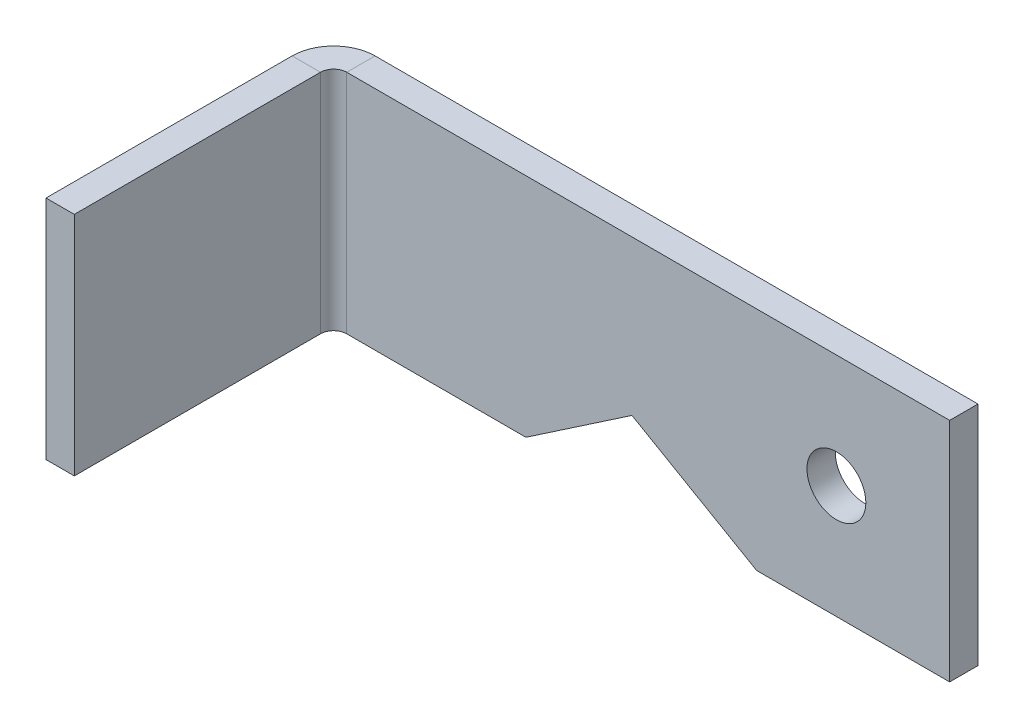
ISO-10303-21;
HEADER;
FILE_DESCRIPTION(('STEP AP214'),'2;1');
FILE_NAME('part.step','',(''),(''),'','','');
FILE_SCHEMA(('AUTOMOTIVE_DESIGN { 1 0 10303 214 1 1 1 1 }'));
ENDSEC;
DATA;
#1=APPLICATION_CONTEXT('core data for automotive mechanical design processes');
#2=APPLICATION_PROTOCOL_DEFINITION('international standard','automotive_design',2000,#1);
#3=PRODUCT_CONTEXT('',#1,'mechanical');
#4=PRODUCT('Part','Part','',(#3));
#5=PRODUCT_RELATED_PRODUCT_CATEGORY('part','',(#4));
#6=PRODUCT_DEFINITION_FORMATION('','',#4);
#7=PRODUCT_DEFINITION_CONTEXT('part definition',#1,'design');
#8=PRODUCT_DEFINITION('design','',#6,#7);
#9=PRODUCT_DEFINITION_SHAPE('','',#8);
#10=(LENGTH_UNIT() NAMED_UNIT(*) SI_UNIT(.MILLI.,.METRE.));
#11=(NAMED_UNIT(*) PLANE_ANGLE_UNIT() SI_UNIT($,.RADIAN.));
#12=(NAMED_UNIT(*) SI_UNIT($,.STERADIAN.) SOLID_ANGLE_UNIT());
#13=UNCERTAINTY_MEASURE_WITH_UNIT(LENGTH_MEASURE(1.E-05),#10,'distance_accuracy_value','');
#14=(GEOMETRIC_REPRESENTATION_CONTEXT(3) GLOBAL_UNCERTAINTY_ASSIGNED_CONTEXT((#13)) GLOBAL_UNIT_ASSIGNED_CONTEXT((#10,
#11,#12)) REPRESENTATION_CONTEXT('',''));
#15=CARTESIAN_POINT('',(0.,0.,0.));
#16=DIRECTION('',(0.,0.,1.));
#17=DIRECTION('',(1.,0.,0.));
#18=AXIS2_PLACEMENT_3D('',#15,#16,#17);
#19=CARTESIAN_POINT('',(-25.,-6.35,-1.5875));
#20=DIRECTION('',(0.,-1.,0.));
#21=DIRECTION('',(0.,0.,-1.));
#22=AXIS2_PLACEMENT_3D('',#19,#20,#21);
#23=PLANE('',#22);
#24=DIRECTION('',(0.,0.,-1.));
#25=VECTOR('',#24,1.);
#26=CARTESIAN_POINT('',(1.24638581634655,-6.35,-1.5875));
#27=LINE('',#26,#25);
#28=CARTESIAN_POINT('',(1.24638581634655,-6.35,0.));
#29=VERTEX_POINT('',#28);
#30=CARTESIAN_POINT('',(1.24638581634655,-6.35,-1.5875));
#31=VERTEX_POINT('',#30);
#32=EDGE_CURVE('E12',#29,#31,#27,.T.);
#33=ORIENTED_EDGE('',*,*,#32,.F.);
#34=DIRECTION('',(1.,0.,0.));
#35=VECTOR('',#34,1.);
#36=CARTESIAN_POINT('',(-25.,-6.35,0.));
#37=LINE('',#36,#35);
#38=CARTESIAN_POINT('',(-8.79806592064473,-6.35,0.));
#39=VERTEX_POINT('',#38);
#40=EDGE_CURVE('E148',#39,#29,#37,.T.);
#41=ORIENTED_EDGE('',*,*,#40,.F.);
#42=DIRECTION('',(0.,0.,1.));
#43=VECTOR('',#42,1.);
#44=CARTESIAN_POINT('',(-8.79806592064473,-6.35,-1.5875));
#45=LINE('',#44,#43);
#46=CARTESIAN_POINT('',(-8.79806592064473,-6.35,-1.5875));
#47=VERTEX_POINT('',#46);
#48=EDGE_CURVE('E170',#47,#39,#45,.T.);
#49=ORIENTED_EDGE('',*,*,#48,.F.);
#50=DIRECTION('',(1.,0.,0.));
#51=VECTOR('',#50,1.);
#52=CARTESIAN_POINT('',(-25.,-6.35,-1.5875));
#53=LINE('',#52,#51);
#54=EDGE_CURVE('E238',#47,#31,#53,.T.);
#55=ORIENTED_EDGE('',*,*,#54,.T.);
#56=EDGE_LOOP('',(#33,#41,#49,#55));
#57=FACE_BOUND('',#56,.T.);
#58=ADVANCED_FACE('F44',(#57),#23,.T.);
#59=CARTESIAN_POINT('',(-11.1221659206447,-6.34999999999999,14.5346659206447));
#60=DIRECTION('',(0.,-1.,0.));
#61=DIRECTION('',(-1.,0.,0.));
#62=AXIS2_PLACEMENT_3D('',#59,#60,#61);
#63=PLANE('',#62);
#64=DIRECTION('',(0.,0.,-1.));
#65=VECTOR('',#64,1.);
#66=CARTESIAN_POINT('',(-11.1221659206447,-6.34999999999999,14.5346659206447));
#67=LINE('',#66,#65);
#68=CARTESIAN_POINT('',(-11.1221659206447,-6.34999999999999,14.5346659206447));
#69=VERTEX_POINT('',#68);
#70=CARTESIAN_POINT('',(-11.1221659206447,-6.35,0.736600000000009));
#71=VERTEX_POINT('',#70);
#72=EDGE_CURVE('E177',#69,#71,#67,.T.);
#73=ORIENTED_EDGE('',*,*,#72,.T.);
#74=DIRECTION('',(1.,0.,0.));
#75=VECTOR('',#74,1.);
#76=CARTESIAN_POINT('',(-11.1221659206447,-6.35,0.736600000000007));
#77=LINE('',#76,#75);
#78=CARTESIAN_POINT('',(-9.53466592064473,-6.35,0.736600000000002));
#79=VERTEX_POINT('',#78);
#80=EDGE_CURVE('E134',#71,#79,#77,.T.);
#81=ORIENTED_EDGE('',*,*,#80,.T.);
#82=DIRECTION('',(0.,0.,-1.));
#83=VECTOR('',#82,1.);
#84=CARTESIAN_POINT('',(-9.53466592064468,-6.34999999999999,14.5346659206447));
#85=LINE('',#84,#83);
#86=CARTESIAN_POINT('',(-9.53466592064468,-6.34999999999999,14.5346659206447));
#87=VERTEX_POINT('',#86);
#88=EDGE_CURVE('E67',#87,#79,#85,.T.);
#89=ORIENTED_EDGE('',*,*,#88,.F.);
#90=DIRECTION('',(1.,0.,0.));
#91=VECTOR('',#90,1.);
#92=CARTESIAN_POINT('',(-11.1221659206447,-6.34999999999999,14.5346659206447));
#93=LINE('',#92,#91);
#94=EDGE_CURVE('E182',#69,#87,#93,.T.);
#95=ORIENTED_EDGE('',*,*,#94,.F.);
#96=EDGE_LOOP('',(#73,#81,#89,#95));
#97=FACE_BOUND('',#96,.T.);
#98=ADVANCED_FACE('F46',(#97),#63,.T.);
#99=CARTESIAN_POINT('',(-11.1221659206447,6.35000000000001,14.5346659206447));
#100=DIRECTION('',(0.,1.,0.));
#101=DIRECTION('',(1.,0.,0.));
#102=AXIS2_PLACEMENT_3D('',#99,#100,#101);
#103=PLANE('',#102);
#104=DIRECTION('',(0.,0.,1.));
#105=VECTOR('',#104,1.);
#106=CARTESIAN_POINT('',(-9.53466592064468,6.35000000000001,14.5346659206447));
#107=LINE('',#106,#105);
#108=CARTESIAN_POINT('',(-9.53466592064473,6.35,0.736600000000002));
#109=VERTEX_POINT('',#108);
#110=CARTESIAN_POINT('',(-9.53466592064468,6.35000000000001,14.5346659206447));
#111=VERTEX_POINT('',#110);
#112=EDGE_CURVE('E181',#109,#111,#107,.T.);
#113=ORIENTED_EDGE('',*,*,#112,.F.);
#114=DIRECTION('',(-1.,0.,0.));
#115=VECTOR('',#114,1.);
#116=CARTESIAN_POINT('',(-11.1221659206447,6.35,0.736600000000007));
#117=LINE('',#116,#115);
#118=CARTESIAN_POINT('',(-11.1221659206447,6.35000000000001,0.736600000000009));
#119=VERTEX_POINT('',#118);
#120=EDGE_CURVE('E190',#109,#119,#117,.T.);
#121=ORIENTED_EDGE('',*,*,#120,.T.);
#122=DIRECTION('',(0.,0.,1.));
#123=VECTOR('',#122,1.);
#124=CARTESIAN_POINT('',(-11.1221659206447,6.35000000000001,14.5346659206447));
#125=LINE('',#124,#123);
#126=CARTESIAN_POINT('',(-11.1221659206447,6.35000000000001,14.5346659206447));
#127=VERTEX_POINT('',#126);
#128=EDGE_CURVE('E178',#119,#127,#125,.T.);
#129=ORIENTED_EDGE('',*,*,#128,.T.);
#130=DIRECTION('',(1.,0.,0.));
#131=VECTOR('',#130,1.);
#132=CARTESIAN_POINT('',(-11.1221659206447,6.35000000000001,14.5346659206447));
#133=LINE('',#132,#131);
#134=EDGE_CURVE('E185',#127,#111,#133,.T.);
#135=ORIENTED_EDGE('',*,*,#134,.T.);
#136=EDGE_LOOP('',(#113,#121,#129,#135));
#137=FACE_BOUND('',#136,.T.);
#138=ADVANCED_FACE('F202',(#137),#103,.T.);
#139=CARTESIAN_POINT('',(-9.53466592064477,0.,-10.4653340793553));
#140=DIRECTION('',(1.,0.,0.));
#141=DIRECTION('',(0.,0.,-1.));
#142=AXIS2_PLACEMENT_3D('',#139,#140,#141);
#143=PLANE('',#142);
#144=ORIENTED_EDGE('',*,*,#88,.T.);
#145=DIRECTION('',(0.,1.,0.));
#146=VECTOR('',#145,1.);
#147=CARTESIAN_POINT('',(-9.53466592064473,0.,0.736600000000002));
#148=LINE('',#147,#146);
#149=EDGE_CURVE('E192',#79,#109,#148,.T.);
#150=ORIENTED_EDGE('',*,*,#149,.T.);
#151=ORIENTED_EDGE('',*,*,#112,.T.);
#152=DIRECTION('',(0.,-1.,0.));
#153=VECTOR('',#152,1.);
#154=CARTESIAN_POINT('',(-9.53466592064468,6.35000000000001,14.5346659206447));
#155=LINE('',#154,#153);
#156=EDGE_CURVE('E179',#111,#87,#155,.T.);
#157=ORIENTED_EDGE('',*,*,#156,.T.);
#158=EDGE_LOOP('',(#144,#150,#151,#157));
#159=FACE_BOUND('',#158,.T.);
#160=ADVANCED_FACE('F292',(#159),#143,.T.);
#161=CARTESIAN_POINT('',(-11.1221659206447,6.35000000000001,14.5346659206447));
#162=DIRECTION('',(0.,0.,1.));
#163=DIRECTION('',(1.,0.,0.));
#164=AXIS2_PLACEMENT_3D('',#161,#162,#163);
#165=PLANE('',#164);
#166=ORIENTED_EDGE('',*,*,#156,.F.);
#167=ORIENTED_EDGE('',*,*,#134,.F.);
#168=DIRECTION('',(0.,-1.,0.));
#169=VECTOR('',#168,1.);
#170=CARTESIAN_POINT('',(-11.1221659206447,6.35000000000001,14.5346659206447));
#171=LINE('',#170,#169);
#172=EDGE_CURVE('E174',#127,#69,#171,.T.);
#173=ORIENTED_EDGE('',*,*,#172,.T.);
#174=ORIENTED_EDGE('',*,*,#94,.T.);
#175=EDGE_LOOP('',(#166,#167,#173,#174));
#176=FACE_BOUND('',#175,.T.);
#177=ADVANCED_FACE('F208',(#176),#165,.T.);
#178=CARTESIAN_POINT('',(-11.1221659206448,0.,-10.4653340793553));
#179=DIRECTION('',(1.,0.,0.));
#180=DIRECTION('',(0.,0.,-1.));
#181=AXIS2_PLACEMENT_3D('',#178,#179,#180);
#182=PLANE('',#181);
#183=DIRECTION('',(0.,1.,0.));
#184=VECTOR('',#183,1.);
#185=CARTESIAN_POINT('',(-11.1221659206447,0.,0.736600000000007));
#186=LINE('',#185,#184);
#187=EDGE_CURVE('E184',#71,#119,#186,.T.);
#188=ORIENTED_EDGE('',*,*,#187,.F.);
#189=ORIENTED_EDGE('',*,*,#72,.F.);
#190=ORIENTED_EDGE('',*,*,#172,.F.);
#191=ORIENTED_EDGE('',*,*,#128,.F.);
#192=EDGE_LOOP('',(#188,#189,#190,#191));
#193=FACE_BOUND('',#192,.T.);
#194=ADVANCED_FACE('F210',(#193),#182,.F.);
#195=CARTESIAN_POINT('',(25.,6.35,-1.5875));
#196=DIRECTION('',(1.,0.,0.));
#197=DIRECTION('',(0.,0.,-1.));
#198=AXIS2_PLACEMENT_3D('',#195,#196,#197);
#199=PLANE('',#198);
#200=DIRECTION('',(0.,1.,0.));
#201=VECTOR('',#200,1.);
#202=CARTESIAN_POINT('',(25.,6.35,0.));
#203=LINE('',#202,#201);
#204=CARTESIAN_POINT('',(25.,-6.35,0.));
#205=VERTEX_POINT('',#204);
#206=CARTESIAN_POINT('',(25.,6.35,0.));
#207=VERTEX_POINT('',#206);
#208=EDGE_CURVE('E151',#205,#207,#203,.T.);
#209=ORIENTED_EDGE('',*,*,#208,.F.);
#210=DIRECTION('',(0.,0.,1.));
#211=VECTOR('',#210,1.);
#212=CARTESIAN_POINT('',(25.,-6.35,-1.5875));
#213=LINE('',#212,#211);
#214=CARTESIAN_POINT('',(25.,-6.35,-1.5875));
#215=VERTEX_POINT('',#214);
#216=EDGE_CURVE('E146',#215,#205,#213,.T.);
#217=ORIENTED_EDGE('',*,*,#216,.F.);
#218=DIRECTION('',(0.,1.,0.));
#219=VECTOR('',#218,1.);
#220=CARTESIAN_POINT('',(25.,6.35,-1.5875));
#221=LINE('',#220,#219);
#222=CARTESIAN_POINT('',(25.,6.35,-1.5875));
#223=VERTEX_POINT('',#222);
#224=EDGE_CURVE('E161',#215,#223,#221,.T.);
#225=ORIENTED_EDGE('',*,*,#224,.T.);
#226=DIRECTION('',(0.,0.,1.));
#227=VECTOR('',#226,1.);
#228=CARTESIAN_POINT('',(25.,6.35,-1.5875));
#229=LINE('',#228,#227);
#230=EDGE_CURVE('E159',#223,#207,#229,.T.);
#231=ORIENTED_EDGE('',*,*,#230,.T.);
#232=EDGE_LOOP('',(#209,#217,#225,#231));
#233=FACE_BOUND('',#232,.T.);
#234=ADVANCED_FACE('F246',(#233),#199,.T.);
#235=CARTESIAN_POINT('',(0.,0.,-1.5875));
#236=DIRECTION('',(0.,0.,1.));
#237=DIRECTION('',(1.,0.,0.));
#238=AXIS2_PLACEMENT_3D('',#235,#236,#237);
#239=PLANE('',#238);
#240=CARTESIAN_POINT('',(18.65,0.,-1.5875));
#241=DIRECTION('',(0.,0.,1.));
#242=DIRECTION('',(1.,0.,0.));
#243=AXIS2_PLACEMENT_3D('',#240,#241,#242);
#244=CIRCLE('',#243,1.65);
#245=CARTESIAN_POINT('',(20.3,0.,-1.5875));
#246=VERTEX_POINT('',#245);
#247=EDGE_CURVE('E142',#246,#246,#244,.T.);
#248=ORIENTED_EDGE('',*,*,#247,.T.);
#249=EDGE_LOOP('',(#248));
#250=FACE_BOUND('',#249,.T.);
#251=DIRECTION('',(-0.866048514638839,0.499959968689355,0.));
#252=VECTOR('',#251,1.);
#253=CARTESIAN_POINT('',(0.794522688723836,1.37630057906431,-1.5875));
#254=LINE('',#253,#252);
#255=CARTESIAN_POINT('',(14.1782965090423,-6.35,-1.5875));
#256=VERTEX_POINT('',#255);
#257=CARTESIAN_POINT('',(7.19013539571283,-2.31581397882383,-1.5875));
#258=VERTEX_POINT('',#257);
#259=EDGE_CURVE('E59',#256,#258,#254,.T.);
#260=ORIENTED_EDGE('',*,*,#259,.T.);
#261=DIRECTION('',(-0.827415786937223,-0.56158981074006,0.));
#262=VECTOR('',#261,1.);
#263=CARTESIAN_POINT('',(3.34373258936088,-4.92647316390549,-1.5875));
#264=LINE('',#263,#262);
#265=EDGE_CURVE('E233',#258,#31,#264,.T.);
#266=ORIENTED_EDGE('',*,*,#265,.T.);
#267=ORIENTED_EDGE('',*,*,#54,.F.);
#268=DIRECTION('',(0.,1.,0.));
#269=VECTOR('',#268,1.);
#270=CARTESIAN_POINT('',(-8.79806592064473,0.,-1.5875));
#271=LINE('',#270,#269);
#272=CARTESIAN_POINT('',(-8.79806592064473,6.35,-1.5875));
#273=VERTEX_POINT('',#272);
#274=EDGE_CURVE('E152',#47,#273,#271,.T.);
#275=ORIENTED_EDGE('',*,*,#274,.T.);
#276=DIRECTION('',(-1.,0.,0.));
#277=VECTOR('',#276,1.);
#278=CARTESIAN_POINT('',(-25.,6.35,-1.5875));
#279=LINE('',#278,#277);
#280=EDGE_CURVE('E149',#223,#273,#279,.T.);
#281=ORIENTED_EDGE('',*,*,#280,.F.);
#282=ORIENTED_EDGE('',*,*,#224,.F.);
#283=EDGE_CURVE('E240',#256,#215,#53,.T.);
#284=ORIENTED_EDGE('',*,*,#283,.F.);
#285=EDGE_LOOP('',(#260,#266,#267,#275,#281,#282,#284));
#286=FACE_BOUND('',#285,.T.);
#287=ADVANCED_FACE('F263',(#250,#286),#239,.F.);
#288=CARTESIAN_POINT('',(-25.,6.35,-1.5875));
#289=DIRECTION('',(0.,1.,0.));
#290=DIRECTION('',(0.,0.,1.));
#291=AXIS2_PLACEMENT_3D('',#288,#289,#290);
#292=PLANE('',#291);
#293=DIRECTION('',(0.,0.,-1.));
#294=VECTOR('',#293,1.);
#295=CARTESIAN_POINT('',(-8.79806592064473,6.35,-1.5875));
#296=LINE('',#295,#294);
#297=CARTESIAN_POINT('',(-8.79806592064473,6.35,0.));
#298=VERTEX_POINT('',#297);
#299=EDGE_CURVE('E164',#298,#273,#296,.T.);
#300=ORIENTED_EDGE('',*,*,#299,.F.);
#301=DIRECTION('',(-1.,0.,0.));
#302=VECTOR('',#301,1.);
#303=CARTESIAN_POINT('',(-25.,6.35,0.));
#304=LINE('',#303,#302);
#305=EDGE_CURVE('E241',#207,#298,#304,.T.);
#306=ORIENTED_EDGE('',*,*,#305,.F.);
#307=ORIENTED_EDGE('',*,*,#230,.F.);
#308=ORIENTED_EDGE('',*,*,#280,.T.);
#309=EDGE_LOOP('',(#300,#306,#307,#308));
#310=FACE_BOUND('',#309,.T.);
#311=ADVANCED_FACE('F250',(#310),#292,.T.);
#312=CARTESIAN_POINT('',(0.,0.,0.));
#313=DIRECTION('',(0.,0.,1.));
#314=DIRECTION('',(1.,0.,0.));
#315=AXIS2_PLACEMENT_3D('',#312,#313,#314);
#316=PLANE('',#315);
#317=CARTESIAN_POINT('',(18.65,0.,0.));
#318=DIRECTION('',(0.,0.,1.));
#319=DIRECTION('',(1.,0.,0.));
#320=AXIS2_PLACEMENT_3D('',#317,#318,#319);
#321=CIRCLE('',#320,1.65);
#322=CARTESIAN_POINT('',(20.3,0.,0.));
#323=VERTEX_POINT('',#322);
#324=EDGE_CURVE('E270',#323,#323,#321,.T.);
#325=ORIENTED_EDGE('',*,*,#324,.F.);
#326=EDGE_LOOP('',(#325));
#327=FACE_BOUND('',#326,.T.);
#328=DIRECTION('',(-0.827415786937223,-0.56158981074006,0.));
#329=VECTOR('',#328,1.);
#330=CARTESIAN_POINT('',(1.24638581634655,-6.35,0.));
#331=LINE('',#330,#329);
#332=CARTESIAN_POINT('',(7.19013539571283,-2.31581397882383,0.));
#333=VERTEX_POINT('',#332);
#334=EDGE_CURVE('E141',#333,#29,#331,.T.);
#335=ORIENTED_EDGE('',*,*,#334,.F.);
#336=DIRECTION('',(-0.866048514638839,0.499959968689355,0.));
#337=VECTOR('',#336,1.);
#338=CARTESIAN_POINT('',(7.19013539571283,-2.31581397882383,0.));
#339=LINE('',#338,#337);
#340=CARTESIAN_POINT('',(14.1782965090423,-6.35,0.));
#341=VERTEX_POINT('',#340);
#342=EDGE_CURVE('E129',#341,#333,#339,.T.);
#343=ORIENTED_EDGE('',*,*,#342,.F.);
#344=EDGE_CURVE('E138',#341,#205,#37,.T.);
#345=ORIENTED_EDGE('',*,*,#344,.T.);
#346=ORIENTED_EDGE('',*,*,#208,.T.);
#347=ORIENTED_EDGE('',*,*,#305,.T.);
#348=DIRECTION('',(0.,1.,0.));
#349=VECTOR('',#348,1.);
#350=CARTESIAN_POINT('',(-8.79806592064473,0.,0.));
#351=LINE('',#350,#349);
#352=EDGE_CURVE('E167',#39,#298,#351,.T.);
#353=ORIENTED_EDGE('',*,*,#352,.F.);
#354=ORIENTED_EDGE('',*,*,#40,.T.);
#355=EDGE_LOOP('',(#335,#343,#345,#346,#347,#353,#354));
#356=FACE_BOUND('',#355,.T.);
#357=ADVANCED_FACE('F136',(#327,#356),#316,.T.);
#358=DIRECTION('',(0.,0.,1.));
#359=VECTOR('',#358,1.);
#360=CARTESIAN_POINT('',(14.1782965090423,-6.35,-1.5875));
#361=LINE('',#360,#359);
#362=EDGE_CURVE('E52',#256,#341,#361,.T.);
#363=ORIENTED_EDGE('',*,*,#362,.F.);
#364=ORIENTED_EDGE('',*,*,#283,.T.);
#365=ORIENTED_EDGE('',*,*,#216,.T.);
#366=ORIENTED_EDGE('',*,*,#344,.F.);
#367=EDGE_LOOP('',(#363,#364,#365,#366));
#368=FACE_BOUND('',#367,.T.);
#369=ADVANCED_FACE('F144',(#368),#23,.T.);
#370=CARTESIAN_POINT('',(-8.79806592064473,-6.35,0.7366));
#371=DIRECTION('',(0.,-1.,0.));
#372=DIRECTION('',(0.,0.,-1.));
#373=AXIS2_PLACEMENT_3D('',#370,#371,#372);
#374=PLANE('',#373);
#375=ORIENTED_EDGE('',*,*,#48,.T.);
#376=CARTESIAN_POINT('',(-8.79806592064473,-6.35,0.7366));
#377=DIRECTION('',(0.,1.,0.));
#378=DIRECTION('',(-1.,0.,0.));
#379=AXIS2_PLACEMENT_3D('',#376,#377,#378);
#380=CIRCLE('',#379,0.7366);
#381=EDGE_CURVE('E222',#39,#79,#380,.T.);
#382=ORIENTED_EDGE('',*,*,#381,.T.);
#383=ORIENTED_EDGE('',*,*,#80,.F.);
#384=CARTESIAN_POINT('',(-8.79806592064473,-6.35,0.7366));
#385=DIRECTION('',(0.,1.,0.));
#386=DIRECTION('',(0.,0.,-1.));
#387=AXIS2_PLACEMENT_3D('',#384,#385,#386);
#388=CIRCLE('',#387,2.3241);
#389=EDGE_CURVE('E219',#47,#71,#388,.T.);
#390=ORIENTED_EDGE('',*,*,#389,.F.);
#391=EDGE_LOOP('',(#375,#382,#383,#390));
#392=FACE_BOUND('',#391,.T.);
#393=ADVANCED_FACE('F218',(#392),#374,.T.);
#394=CARTESIAN_POINT('',(-8.79806592064473,6.35,0.7366));
#395=DIRECTION('',(0.,1.,0.));
#396=DIRECTION('',(0.,0.,1.));
#397=AXIS2_PLACEMENT_3D('',#394,#395,#396);
#398=PLANE('',#397);
#399=ORIENTED_EDGE('',*,*,#120,.F.);
#400=CARTESIAN_POINT('',(-8.79806592064473,6.35000000000001,0.7366));
#401=DIRECTION('',(0.,1.,0.));
#402=DIRECTION('',(-1.,0.,0.));
#403=AXIS2_PLACEMENT_3D('',#400,#401,#402);
#404=CIRCLE('',#403,0.7366);
#405=EDGE_CURVE('E227',#109,#298,#404,.F.);
#406=ORIENTED_EDGE('',*,*,#405,.T.);
#407=ORIENTED_EDGE('',*,*,#299,.T.);
#408=CARTESIAN_POINT('',(-8.79806592064473,6.35,0.7366));
#409=DIRECTION('',(0.,-1.,0.));
#410=DIRECTION('',(0.,0.,1.));
#411=AXIS2_PLACEMENT_3D('',#408,#409,#410);
#412=CIRCLE('',#411,2.3241);
#413=EDGE_CURVE('E173',#119,#273,#412,.T.);
#414=ORIENTED_EDGE('',*,*,#413,.F.);
#415=EDGE_LOOP('',(#399,#406,#407,#414));
#416=FACE_BOUND('',#415,.T.);
#417=ADVANCED_FACE('F253',(#416),#398,.T.);
#418=CARTESIAN_POINT('',(-8.79806592064473,-13.0226240971036,0.7366));
#419=DIRECTION('',(0.,1.,0.));
#420=DIRECTION('',(-1.,0.,0.));
#421=AXIS2_PLACEMENT_3D('',#418,#419,#420);
#422=CYLINDRICAL_SURFACE('',#421,2.3241);
#423=ORIENTED_EDGE('',*,*,#413,.T.);
#424=ORIENTED_EDGE('',*,*,#274,.F.);
#425=ORIENTED_EDGE('',*,*,#389,.T.);
#426=ORIENTED_EDGE('',*,*,#187,.T.);
#427=EDGE_LOOP('',(#423,#424,#425,#426));
#428=FACE_BOUND('',#427,.T.);
#429=ADVANCED_FACE('F225',(#428),#422,.T.);
#430=CARTESIAN_POINT('',(-8.79806592064473,-13.0226240971036,0.7366));
#431=DIRECTION('',(0.,1.,0.));
#432=DIRECTION('',(-1.,0.,0.));
#433=AXIS2_PLACEMENT_3D('',#430,#431,#432);
#434=CYLINDRICAL_SURFACE('',#433,0.7366);
#435=ORIENTED_EDGE('',*,*,#405,.F.);
#436=ORIENTED_EDGE('',*,*,#149,.F.);
#437=ORIENTED_EDGE('',*,*,#381,.F.);
#438=ORIENTED_EDGE('',*,*,#352,.T.);
#439=EDGE_LOOP('',(#435,#436,#437,#438));
#440=FACE_BOUND('',#439,.T.);
#441=ADVANCED_FACE('F255',(#440),#434,.F.);
#442=CARTESIAN_POINT('',(1.24638581634655,-6.35,-10.));
#443=DIRECTION('',(-0.56158981074006,0.827415786937223,0.));
#444=DIRECTION('',(-0.827415786937223,-0.56158981074006,0.));
#445=AXIS2_PLACEMENT_3D('',#442,#443,#444);
#446=PLANE('',#445);
#447=DIRECTION('',(0.,0.,1.));
#448=VECTOR('',#447,1.);
#449=CARTESIAN_POINT('',(7.19013539571283,-2.31581397882383,-10.));
#450=LINE('',#449,#448);
#451=EDGE_CURVE('E264',#258,#333,#450,.T.);
#452=ORIENTED_EDGE('',*,*,#451,.T.);
#453=ORIENTED_EDGE('',*,*,#334,.T.);
#454=ORIENTED_EDGE('',*,*,#32,.T.);
#455=ORIENTED_EDGE('',*,*,#265,.F.);
#456=EDGE_LOOP('',(#452,#453,#454,#455));
#457=FACE_BOUND('',#456,.T.);
#458=ADVANCED_FACE('F261',(#457),#446,.F.);
#459=CARTESIAN_POINT('',(7.19013539571283,-2.31581397882383,-10.));
#460=DIRECTION('',(0.499959968689355,0.866048514638839,0.));
#461=DIRECTION('',(-0.866048514638839,0.499959968689355,0.));
#462=AXIS2_PLACEMENT_3D('',#459,#460,#461);
#463=PLANE('',#462);
#464=ORIENTED_EDGE('',*,*,#362,.T.);
#465=ORIENTED_EDGE('',*,*,#342,.T.);
#466=ORIENTED_EDGE('',*,*,#451,.F.);
#467=ORIENTED_EDGE('',*,*,#259,.F.);
#468=EDGE_LOOP('',(#464,#465,#466,#467));
#469=FACE_BOUND('',#468,.T.);
#470=ADVANCED_FACE('F128',(#469),#463,.F.);
#471=CARTESIAN_POINT('',(18.65,0.,-10.));
#472=DIRECTION('',(0.,0.,1.));
#473=DIRECTION('',(1.,0.,0.));
#474=AXIS2_PLACEMENT_3D('',#471,#472,#473);
#475=CYLINDRICAL_SURFACE('',#474,1.65);
#476=ORIENTED_EDGE('',*,*,#324,.T.);
#477=EDGE_LOOP('',(#476));
#478=FACE_BOUND('',#477,.T.);
#479=ORIENTED_EDGE('',*,*,#247,.F.);
#480=EDGE_LOOP('',(#479));
#481=FACE_BOUND('',#480,.T.);
#482=ADVANCED_FACE('F274',(#478,#481),#475,.F.);
#483=CLOSED_SHELL('',(#58,#98,#138,#160,#177,#194,#234,#287,#311,#357,#369,#393,#417,#429,#441,
#458,#470,#482));
#484=MANIFOLD_SOLID_BREP('B2',#483);
#485=ADVANCED_BREP_SHAPE_REPRESENTATION('',(#18,#484),#14);
#486=SHAPE_DEFINITION_REPRESENTATION(#9,#485);
ENDSEC;
END-ISO-10303-21;
